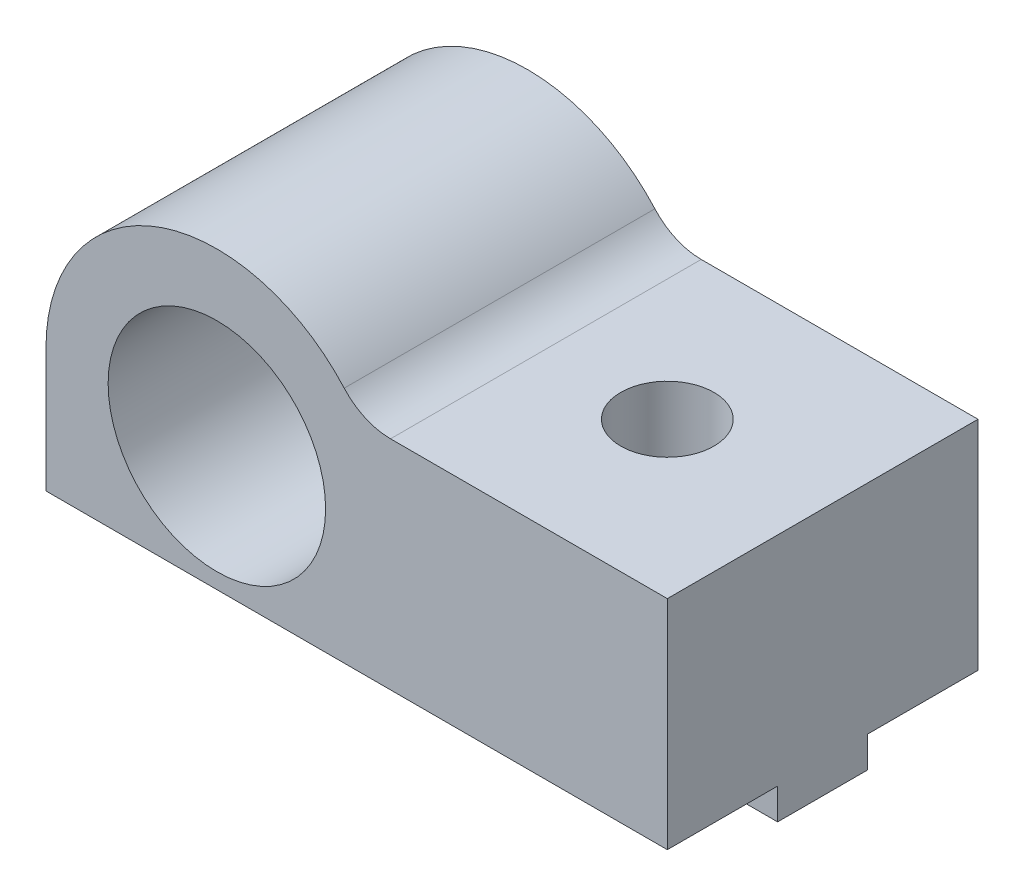
ISO-10303-21;
HEADER;
FILE_DESCRIPTION(('STEP AP214'),'2;1');
FILE_NAME('part.step','',(''),(''),'','','');
FILE_SCHEMA(('AUTOMOTIVE_DESIGN { 1 0 10303 214 1 1 1 1 }'));
ENDSEC;
DATA;
#1=APPLICATION_CONTEXT('core data for automotive mechanical design processes');
#2=APPLICATION_PROTOCOL_DEFINITION('international standard','automotive_design',2000,#1);
#3=PRODUCT_CONTEXT('',#1,'mechanical');
#4=PRODUCT('Part','Part','',(#3));
#5=PRODUCT_RELATED_PRODUCT_CATEGORY('part','',(#4));
#6=PRODUCT_DEFINITION_FORMATION('','',#4);
#7=PRODUCT_DEFINITION_CONTEXT('part definition',#1,'design');
#8=PRODUCT_DEFINITION('design','',#6,#7);
#9=PRODUCT_DEFINITION_SHAPE('','',#8);
#10=(LENGTH_UNIT() NAMED_UNIT(*) SI_UNIT(.MILLI.,.METRE.));
#11=(NAMED_UNIT(*) PLANE_ANGLE_UNIT() SI_UNIT($,.RADIAN.));
#12=(NAMED_UNIT(*) SI_UNIT($,.STERADIAN.) SOLID_ANGLE_UNIT());
#13=UNCERTAINTY_MEASURE_WITH_UNIT(LENGTH_MEASURE(1.E-05),#10,'distance_accuracy_value','');
#14=(GEOMETRIC_REPRESENTATION_CONTEXT(3) GLOBAL_UNCERTAINTY_ASSIGNED_CONTEXT((#13)) GLOBAL_UNIT_ASSIGNED_CONTEXT((#10,
#11,#12)) REPRESENTATION_CONTEXT('',''));
#15=CARTESIAN_POINT('',(0.,0.,0.));
#16=DIRECTION('',(0.,0.,1.));
#17=DIRECTION('',(1.,0.,0.));
#18=AXIS2_PLACEMENT_3D('',#15,#16,#17);
#19=CARTESIAN_POINT('',(-5.5,-5.,3.55));
#20=DIRECTION('',(0.,0.,1.));
#21=DIRECTION('',(1.,0.,0.));
#22=AXIS2_PLACEMENT_3D('',#19,#20,#21);
#23=PLANE('',#22);
#24=DIRECTION('',(1.,0.,0.));
#25=VECTOR('',#24,1.);
#26=CARTESIAN_POINT('',(-5.5,-5.,3.55));
#27=LINE('',#26,#25);
#28=CARTESIAN_POINT('',(9.88405728739344,-5.,3.55));
#29=VERTEX_POINT('',#28);
#30=CARTESIAN_POINT('',(14.5,-5.,3.55));
#31=VERTEX_POINT('',#30);
#32=EDGE_CURVE('E293',#29,#31,#27,.T.);
#33=ORIENTED_EDGE('',*,*,#32,.F.);
#34=DIRECTION('',(0.,1.,0.));
#35=VECTOR('',#34,1.);
#36=CARTESIAN_POINT('',(9.88405728739344,-5.,3.55));
#37=LINE('',#36,#35);
#38=CARTESIAN_POINT('',(9.88405728739344,-4.,3.55));
#39=VERTEX_POINT('',#38);
#40=EDGE_CURVE('E139',#29,#39,#37,.T.);
#41=ORIENTED_EDGE('',*,*,#40,.T.);
#42=DIRECTION('',(1.,0.,0.));
#43=VECTOR('',#42,1.);
#44=CARTESIAN_POINT('',(-5.5,-4.,3.55));
#45=LINE('',#44,#43);
#46=CARTESIAN_POINT('',(14.5,-4.,3.55));
#47=VERTEX_POINT('',#46);
#48=EDGE_CURVE('E173',#39,#47,#45,.T.);
#49=ORIENTED_EDGE('',*,*,#48,.T.);
#50=DIRECTION('',(0.,1.,0.));
#51=VECTOR('',#50,1.);
#52=CARTESIAN_POINT('',(14.5,-5.,3.55));
#53=LINE('',#52,#51);
#54=EDGE_CURVE('E177',#31,#47,#53,.T.);
#55=ORIENTED_EDGE('',*,*,#54,.F.);
#56=EDGE_LOOP('',(#33,#41,#49,#55));
#57=FACE_BOUND('',#56,.T.);
#58=ADVANCED_FACE('F33',(#57),#23,.F.);
#59=CARTESIAN_POINT('',(-5.5,-5.,6.45));
#60=DIRECTION('',(0.,0.,-1.));
#61=DIRECTION('',(-1.,0.,0.));
#62=AXIS2_PLACEMENT_3D('',#59,#60,#61);
#63=PLANE('',#62);
#64=DIRECTION('',(-1.,0.,0.));
#65=VECTOR('',#64,1.);
#66=CARTESIAN_POINT('',(-5.5,-5.,6.45));
#67=LINE('',#66,#65);
#68=CARTESIAN_POINT('',(9.11594271260657,-5.,6.45));
#69=VERTEX_POINT('',#68);
#70=CARTESIAN_POINT('',(-5.5,-5.,6.45));
#71=VERTEX_POINT('',#70);
#72=EDGE_CURVE('E161',#69,#71,#67,.T.);
#73=ORIENTED_EDGE('',*,*,#72,.F.);
#74=DIRECTION('',(0.,1.,0.));
#75=VECTOR('',#74,1.);
#76=CARTESIAN_POINT('',(9.11594271260657,-5.,6.45));
#77=LINE('',#76,#75);
#78=CARTESIAN_POINT('',(9.11594271260657,-4.,6.45));
#79=VERTEX_POINT('',#78);
#80=EDGE_CURVE('E288',#69,#79,#77,.T.);
#81=ORIENTED_EDGE('',*,*,#80,.T.);
#82=DIRECTION('',(-1.,0.,0.));
#83=VECTOR('',#82,1.);
#84=CARTESIAN_POINT('',(-5.5,-4.,6.45));
#85=LINE('',#84,#83);
#86=CARTESIAN_POINT('',(-5.5,-4.,6.45));
#87=VERTEX_POINT('',#86);
#88=EDGE_CURVE('E172',#79,#87,#85,.T.);
#89=ORIENTED_EDGE('',*,*,#88,.T.);
#90=DIRECTION('',(0.,1.,0.));
#91=VECTOR('',#90,1.);
#92=CARTESIAN_POINT('',(-5.5,-5.,6.45));
#93=LINE('',#92,#91);
#94=EDGE_CURVE('E160',#71,#87,#93,.T.);
#95=ORIENTED_EDGE('',*,*,#94,.F.);
#96=EDGE_LOOP('',(#73,#81,#89,#95));
#97=FACE_BOUND('',#96,.T.);
#98=ADVANCED_FACE('F258',(#97),#63,.F.);
#99=CARTESIAN_POINT('',(0.,-5.,0.));
#100=DIRECTION('',(0.,-1.,0.));
#101=DIRECTION('',(0.,0.,-1.));
#102=AXIS2_PLACEMENT_3D('',#99,#100,#101);
#103=PLANE('',#102);
#104=CARTESIAN_POINT('',(9.5,-5.,5.));
#105=DIRECTION('',(0.,-1.,0.));
#106=DIRECTION('',(0.,0.,-1.));
#107=AXIS2_PLACEMENT_3D('',#104,#105,#106);
#108=CIRCLE('',#107,1.5);
#109=CARTESIAN_POINT('',(9.88405728739343,-5.,6.45));
#110=VERTEX_POINT('',#109);
#111=EDGE_CURVE('E133',#29,#110,#108,.T.);
#112=ORIENTED_EDGE('',*,*,#111,.F.);
#113=ORIENTED_EDGE('',*,*,#32,.T.);
#114=DIRECTION('',(0.,0.,1.));
#115=VECTOR('',#114,1.);
#116=CARTESIAN_POINT('',(14.5,-5.,6.45));
#117=LINE('',#116,#115);
#118=CARTESIAN_POINT('',(14.5,-5.,6.45));
#119=VERTEX_POINT('',#118);
#120=EDGE_CURVE('E158',#31,#119,#117,.T.);
#121=ORIENTED_EDGE('',*,*,#120,.T.);
#122=EDGE_CURVE('E151',#119,#110,#67,.T.);
#123=ORIENTED_EDGE('',*,*,#122,.T.);
#124=EDGE_LOOP('',(#112,#113,#121,#123));
#125=FACE_BOUND('',#124,.T.);
#126=ADVANCED_FACE('F156',(#125),#103,.T.);
#127=CARTESIAN_POINT('',(-5.5,-4.,10.));
#128=DIRECTION('',(0.,1.,0.));
#129=DIRECTION('',(0.,0.,1.));
#130=AXIS2_PLACEMENT_3D('',#127,#128,#129);
#131=PLANE('',#130);
#132=ORIENTED_EDGE('',*,*,#88,.F.);
#133=CARTESIAN_POINT('',(9.5,-4.,5.));
#134=DIRECTION('',(0.,1.,0.));
#135=DIRECTION('',(0.,0.,1.));
#136=AXIS2_PLACEMENT_3D('',#133,#134,#135);
#137=CIRCLE('',#136,1.5);
#138=CARTESIAN_POINT('',(9.88405728739343,-4.,6.45));
#139=VERTEX_POINT('',#138);
#140=EDGE_CURVE('E153',#79,#139,#137,.T.);
#141=ORIENTED_EDGE('',*,*,#140,.T.);
#142=CARTESIAN_POINT('',(14.5,-4.,6.45));
#143=VERTEX_POINT('',#142);
#144=EDGE_CURVE('E152',#143,#139,#85,.T.);
#145=ORIENTED_EDGE('',*,*,#144,.F.);
#146=DIRECTION('',(0.,0.,-1.));
#147=VECTOR('',#146,1.);
#148=CARTESIAN_POINT('',(14.5,-4.,10.));
#149=LINE('',#148,#147);
#150=CARTESIAN_POINT('',(14.5,-4.,10.));
#151=VERTEX_POINT('',#150);
#152=EDGE_CURVE('E215',#151,#143,#149,.T.);
#153=ORIENTED_EDGE('',*,*,#152,.F.);
#154=DIRECTION('',(1.,0.,0.));
#155=VECTOR('',#154,1.);
#156=CARTESIAN_POINT('',(-5.5,-4.,10.));
#157=LINE('',#156,#155);
#158=CARTESIAN_POINT('',(-5.5,-4.,10.));
#159=VERTEX_POINT('',#158);
#160=EDGE_CURVE('E197',#159,#151,#157,.T.);
#161=ORIENTED_EDGE('',*,*,#160,.F.);
#162=DIRECTION('',(0.,0.,-1.));
#163=VECTOR('',#162,1.);
#164=CARTESIAN_POINT('',(-5.5,-4.,10.));
#165=LINE('',#164,#163);
#166=EDGE_CURVE('E219',#159,#87,#165,.T.);
#167=ORIENTED_EDGE('',*,*,#166,.T.);
#168=EDGE_LOOP('',(#132,#141,#145,#153,#161,#167));
#169=FACE_BOUND('',#168,.T.);
#170=ADVANCED_FACE('F303',(#169),#131,.F.);
#171=ORIENTED_EDGE('',*,*,#48,.F.);
#172=CARTESIAN_POINT('',(9.5,-4.,5.));
#173=DIRECTION('',(0.,1.,0.));
#174=DIRECTION('',(0.,0.,1.));
#175=AXIS2_PLACEMENT_3D('',#172,#173,#174);
#176=CIRCLE('',#175,1.5);
#177=CARTESIAN_POINT('',(9.11594271260656,-4.,3.55));
#178=VERTEX_POINT('',#177);
#179=EDGE_CURVE('E284',#39,#178,#176,.T.);
#180=ORIENTED_EDGE('',*,*,#179,.T.);
#181=CARTESIAN_POINT('',(-5.5,-4.,3.55));
#182=VERTEX_POINT('',#181);
#183=EDGE_CURVE('E169',#182,#178,#45,.T.);
#184=ORIENTED_EDGE('',*,*,#183,.F.);
#185=CARTESIAN_POINT('',(-5.5,-4.,0.));
#186=VERTEX_POINT('',#185);
#187=EDGE_CURVE('E218',#182,#186,#165,.T.);
#188=ORIENTED_EDGE('',*,*,#187,.T.);
#189=DIRECTION('',(1.,0.,0.));
#190=VECTOR('',#189,1.);
#191=CARTESIAN_POINT('',(-5.5,-4.,0.));
#192=LINE('',#191,#190);
#193=CARTESIAN_POINT('',(14.5,-4.,0.));
#194=VERTEX_POINT('',#193);
#195=EDGE_CURVE('E208',#186,#194,#192,.T.);
#196=ORIENTED_EDGE('',*,*,#195,.T.);
#197=EDGE_CURVE('E214',#47,#194,#149,.T.);
#198=ORIENTED_EDGE('',*,*,#197,.F.);
#199=EDGE_LOOP('',(#171,#180,#184,#188,#196,#198));
#200=FACE_BOUND('',#199,.T.);
#201=ADVANCED_FACE('F283',(#200),#131,.F.);
#202=CARTESIAN_POINT('',(0.,0.,10.));
#203=DIRECTION('',(0.,0.,-1.));
#204=DIRECTION('',(-1.,0.,0.));
#205=AXIS2_PLACEMENT_3D('',#202,#203,#204);
#206=PLANE('',#205);
#207=DIRECTION('',(-1.,0.,0.));
#208=VECTOR('',#207,1.);
#209=CARTESIAN_POINT('',(14.5,3.,10.));
#210=LINE('',#209,#208);
#211=CARTESIAN_POINT('',(14.5,3.,10.));
#212=VERTEX_POINT('',#211);
#213=CARTESIAN_POINT('',(5.59016994374947,3.,10.));
#214=VERTEX_POINT('',#213);
#215=EDGE_CURVE('E190',#212,#214,#210,.T.);
#216=ORIENTED_EDGE('',*,*,#215,.T.);
#217=CARTESIAN_POINT('',(5.59016994374947,5.,10.));
#218=DIRECTION('',(0.,0.,-1.));
#219=DIRECTION('',(-1.,0.,0.));
#220=AXIS2_PLACEMENT_3D('',#217,#218,#219);
#221=CIRCLE('',#220,2.);
#222=CARTESIAN_POINT('',(4.09945795874961,3.66666666666667,10.));
#223=VERTEX_POINT('',#222);
#224=EDGE_CURVE('E11',#214,#223,#221,.T.);
#225=ORIENTED_EDGE('',*,*,#224,.T.);
#226=CARTESIAN_POINT('',(0.,0.,10.));
#227=DIRECTION('',(0.,0.,1.));
#228=DIRECTION('',(-1.,0.,0.));
#229=AXIS2_PLACEMENT_3D('',#226,#227,#228);
#230=CIRCLE('',#229,5.5);
#231=CARTESIAN_POINT('',(-5.5,0.,10.));
#232=VERTEX_POINT('',#231);
#233=EDGE_CURVE('E192',#223,#232,#230,.T.);
#234=ORIENTED_EDGE('',*,*,#233,.T.);
#235=DIRECTION('',(0.,-1.,0.));
#236=VECTOR('',#235,1.);
#237=CARTESIAN_POINT('',(-5.5,0.,10.));
#238=LINE('',#237,#236);
#239=EDGE_CURVE('E195',#232,#159,#238,.T.);
#240=ORIENTED_EDGE('',*,*,#239,.T.);
#241=ORIENTED_EDGE('',*,*,#160,.T.);
#242=DIRECTION('',(0.,1.,0.));
#243=VECTOR('',#242,1.);
#244=CARTESIAN_POINT('',(14.5,-4.,10.));
#245=LINE('',#244,#243);
#246=EDGE_CURVE('E199',#151,#212,#245,.T.);
#247=ORIENTED_EDGE('',*,*,#246,.T.);
#248=EDGE_LOOP('',(#216,#225,#234,#240,#241,#247));
#249=FACE_BOUND('',#248,.T.);
#250=CARTESIAN_POINT('',(0.,0.,10.));
#251=DIRECTION('',(0.,0.,1.));
#252=DIRECTION('',(1.,0.,0.));
#253=AXIS2_PLACEMENT_3D('',#250,#251,#252);
#254=CIRCLE('',#253,3.5);
#255=CARTESIAN_POINT('',(3.5,0.,10.));
#256=VERTEX_POINT('',#255);
#257=EDGE_CURVE('E184',#256,#256,#254,.T.);
#258=ORIENTED_EDGE('',*,*,#257,.F.);
#259=EDGE_LOOP('',(#258));
#260=FACE_BOUND('',#259,.T.);
#261=ADVANCED_FACE('F247',(#249,#260),#206,.F.);
#262=CARTESIAN_POINT('',(0.,0.,0.));
#263=DIRECTION('',(0.,0.,-1.));
#264=DIRECTION('',(-1.,0.,0.));
#265=AXIS2_PLACEMENT_3D('',#262,#263,#264);
#266=PLANE('',#265);
#267=DIRECTION('',(-1.,0.,0.));
#268=VECTOR('',#267,1.);
#269=CARTESIAN_POINT('',(14.5,3.,0.));
#270=LINE('',#269,#268);
#271=CARTESIAN_POINT('',(14.5,3.,0.));
#272=VERTEX_POINT('',#271);
#273=CARTESIAN_POINT('',(5.59016994374947,3.,0.));
#274=VERTEX_POINT('',#273);
#275=EDGE_CURVE('E187',#272,#274,#270,.T.);
#276=ORIENTED_EDGE('',*,*,#275,.F.);
#277=DIRECTION('',(0.,1.,0.));
#278=VECTOR('',#277,1.);
#279=CARTESIAN_POINT('',(14.5,-4.,0.));
#280=LINE('',#279,#278);
#281=EDGE_CURVE('E193',#194,#272,#280,.T.);
#282=ORIENTED_EDGE('',*,*,#281,.F.);
#283=ORIENTED_EDGE('',*,*,#195,.F.);
#284=DIRECTION('',(0.,-1.,0.));
#285=VECTOR('',#284,1.);
#286=CARTESIAN_POINT('',(-5.5,0.,0.));
#287=LINE('',#286,#285);
#288=CARTESIAN_POINT('',(-5.5,0.,0.));
#289=VERTEX_POINT('',#288);
#290=EDGE_CURVE('E205',#289,#186,#287,.T.);
#291=ORIENTED_EDGE('',*,*,#290,.F.);
#292=CARTESIAN_POINT('',(0.,0.,0.));
#293=DIRECTION('',(0.,0.,1.));
#294=DIRECTION('',(-1.,0.,0.));
#295=AXIS2_PLACEMENT_3D('',#292,#293,#294);
#296=CIRCLE('',#295,5.5);
#297=CARTESIAN_POINT('',(4.09945795874961,3.66666666666667,0.));
#298=VERTEX_POINT('',#297);
#299=EDGE_CURVE('E203',#298,#289,#296,.T.);
#300=ORIENTED_EDGE('',*,*,#299,.F.);
#301=CARTESIAN_POINT('',(5.59016994374947,5.,0.));
#302=DIRECTION('',(0.,0.,-1.));
#303=DIRECTION('',(-1.,0.,0.));
#304=AXIS2_PLACEMENT_3D('',#301,#302,#303);
#305=CIRCLE('',#304,2.);
#306=EDGE_CURVE('E41',#298,#274,#305,.F.);
#307=ORIENTED_EDGE('',*,*,#306,.T.);
#308=EDGE_LOOP('',(#276,#282,#283,#291,#300,#307));
#309=FACE_BOUND('',#308,.T.);
#310=CARTESIAN_POINT('',(0.,0.,0.));
#311=DIRECTION('',(0.,0.,1.));
#312=DIRECTION('',(1.,0.,0.));
#313=AXIS2_PLACEMENT_3D('',#310,#311,#312);
#314=CIRCLE('',#313,3.5);
#315=CARTESIAN_POINT('',(3.5,0.,0.));
#316=VERTEX_POINT('',#315);
#317=EDGE_CURVE('E183',#316,#316,#314,.T.);
#318=ORIENTED_EDGE('',*,*,#317,.T.);
#319=EDGE_LOOP('',(#318));
#320=FACE_BOUND('',#319,.T.);
#321=ADVANCED_FACE('F235',(#309,#320),#266,.T.);
#322=CARTESIAN_POINT('',(14.5,3.,10.));
#323=DIRECTION('',(0.,-1.,0.));
#324=DIRECTION('',(1.,0.,0.));
#325=AXIS2_PLACEMENT_3D('',#322,#323,#324);
#326=PLANE('',#325);
#327=CARTESIAN_POINT('',(9.5,3.,5.));
#328=DIRECTION('',(0.,1.,0.));
#329=DIRECTION('',(-1.,0.,0.));
#330=AXIS2_PLACEMENT_3D('',#327,#328,#329);
#331=CIRCLE('',#330,1.5);
#332=CARTESIAN_POINT('',(8.,3.,5.));
#333=VERTEX_POINT('',#332);
#334=EDGE_CURVE('E154',#333,#333,#331,.T.);
#335=ORIENTED_EDGE('',*,*,#334,.F.);
#336=EDGE_LOOP('',(#335));
#337=FACE_BOUND('',#336,.T.);
#338=ORIENTED_EDGE('',*,*,#275,.T.);
#339=DIRECTION('',(0.,0.,1.));
#340=VECTOR('',#339,1.);
#341=CARTESIAN_POINT('',(5.59016994374947,3.,10.));
#342=LINE('',#341,#340);
#343=EDGE_CURVE('E48',#274,#214,#342,.T.);
#344=ORIENTED_EDGE('',*,*,#343,.T.);
#345=ORIENTED_EDGE('',*,*,#215,.F.);
#346=DIRECTION('',(0.,0.,-1.));
#347=VECTOR('',#346,1.);
#348=CARTESIAN_POINT('',(14.5,3.,10.));
#349=LINE('',#348,#347);
#350=EDGE_CURVE('E201',#212,#272,#349,.T.);
#351=ORIENTED_EDGE('',*,*,#350,.T.);
#352=EDGE_LOOP('',(#338,#344,#345,#351));
#353=FACE_BOUND('',#352,.T.);
#354=ADVANCED_FACE('F310',(#337,#353),#326,.F.);
#355=CARTESIAN_POINT('',(0.,0.,10.));
#356=DIRECTION('',(0.,0.,-1.));
#357=DIRECTION('',(-1.,0.,0.));
#358=AXIS2_PLACEMENT_3D('',#355,#356,#357);
#359=CYLINDRICAL_SURFACE('',#358,5.5);
#360=ORIENTED_EDGE('',*,*,#233,.F.);
#361=DIRECTION('',(0.,0.,-1.));
#362=VECTOR('',#361,1.);
#363=CARTESIAN_POINT('',(4.09945795874961,3.66666666666667,10.));
#364=LINE('',#363,#362);
#365=EDGE_CURVE('E143',#223,#298,#364,.T.);
#366=ORIENTED_EDGE('',*,*,#365,.T.);
#367=ORIENTED_EDGE('',*,*,#299,.T.);
#368=DIRECTION('',(0.,0.,-1.));
#369=VECTOR('',#368,1.);
#370=CARTESIAN_POINT('',(-5.5,0.,10.));
#371=LINE('',#370,#369);
#372=EDGE_CURVE('E222',#232,#289,#371,.T.);
#373=ORIENTED_EDGE('',*,*,#372,.F.);
#374=EDGE_LOOP('',(#360,#366,#367,#373));
#375=FACE_BOUND('',#374,.T.);
#376=ADVANCED_FACE('F230',(#375),#359,.T.);
#377=CARTESIAN_POINT('',(-5.5,0.,10.));
#378=DIRECTION('',(1.,0.,0.));
#379=DIRECTION('',(0.,1.,0.));
#380=AXIS2_PLACEMENT_3D('',#377,#378,#379);
#381=PLANE('',#380);
#382=ORIENTED_EDGE('',*,*,#290,.T.);
#383=ORIENTED_EDGE('',*,*,#187,.F.);
#384=DIRECTION('',(0.,1.,0.));
#385=VECTOR('',#384,1.);
#386=CARTESIAN_POINT('',(-5.5,-5.,3.55));
#387=LINE('',#386,#385);
#388=CARTESIAN_POINT('',(-5.5,-5.,3.55));
#389=VERTEX_POINT('',#388);
#390=EDGE_CURVE('E180',#389,#182,#387,.T.);
#391=ORIENTED_EDGE('',*,*,#390,.F.);
#392=DIRECTION('',(0.,0.,-1.));
#393=VECTOR('',#392,1.);
#394=CARTESIAN_POINT('',(-5.5,-5.,6.45));
#395=LINE('',#394,#393);
#396=EDGE_CURVE('E174',#71,#389,#395,.T.);
#397=ORIENTED_EDGE('',*,*,#396,.F.);
#398=ORIENTED_EDGE('',*,*,#94,.T.);
#399=ORIENTED_EDGE('',*,*,#166,.F.);
#400=ORIENTED_EDGE('',*,*,#239,.F.);
#401=ORIENTED_EDGE('',*,*,#372,.T.);
#402=EDGE_LOOP('',(#382,#383,#391,#397,#398,#399,#400,#401));
#403=FACE_BOUND('',#402,.T.);
#404=ADVANCED_FACE('F241',(#403),#381,.F.);
#405=CARTESIAN_POINT('',(14.5,-4.,10.));
#406=DIRECTION('',(-1.,0.,0.));
#407=DIRECTION('',(0.,-1.,0.));
#408=AXIS2_PLACEMENT_3D('',#405,#406,#407);
#409=PLANE('',#408);
#410=ORIENTED_EDGE('',*,*,#281,.T.);
#411=ORIENTED_EDGE('',*,*,#350,.F.);
#412=ORIENTED_EDGE('',*,*,#246,.F.);
#413=ORIENTED_EDGE('',*,*,#152,.T.);
#414=DIRECTION('',(0.,1.,0.));
#415=VECTOR('',#414,1.);
#416=CARTESIAN_POINT('',(14.5,-5.,6.45));
#417=LINE('',#416,#415);
#418=EDGE_CURVE('E164',#119,#143,#417,.T.);
#419=ORIENTED_EDGE('',*,*,#418,.F.);
#420=ORIENTED_EDGE('',*,*,#120,.F.);
#421=ORIENTED_EDGE('',*,*,#54,.T.);
#422=ORIENTED_EDGE('',*,*,#197,.T.);
#423=EDGE_LOOP('',(#410,#411,#412,#413,#419,#420,#421,#422));
#424=FACE_BOUND('',#423,.T.);
#425=ADVANCED_FACE('F275',(#424),#409,.F.);
#426=CARTESIAN_POINT('',(0.,0.,10.));
#427=DIRECTION('',(0.,0.,-1.));
#428=DIRECTION('',(-1.,0.,0.));
#429=AXIS2_PLACEMENT_3D('',#426,#427,#428);
#430=CYLINDRICAL_SURFACE('',#429,3.5);
#431=ORIENTED_EDGE('',*,*,#257,.T.);
#432=EDGE_LOOP('',(#431));
#433=FACE_BOUND('',#432,.T.);
#434=ORIENTED_EDGE('',*,*,#317,.F.);
#435=EDGE_LOOP('',(#434));
#436=FACE_BOUND('',#435,.T.);
#437=ADVANCED_FACE('F269',(#433,#436),#430,.F.);
#438=ORIENTED_EDGE('',*,*,#183,.T.);
#439=DIRECTION('',(0.,1.,0.));
#440=VECTOR('',#439,1.);
#441=CARTESIAN_POINT('',(9.11594271260656,-5.,3.55));
#442=LINE('',#441,#440);
#443=CARTESIAN_POINT('',(9.11594271260656,-5.,3.55));
#444=VERTEX_POINT('',#443);
#445=EDGE_CURVE('E278',#178,#444,#442,.F.);
#446=ORIENTED_EDGE('',*,*,#445,.T.);
#447=EDGE_CURVE('E294',#389,#444,#27,.T.);
#448=ORIENTED_EDGE('',*,*,#447,.F.);
#449=ORIENTED_EDGE('',*,*,#390,.T.);
#450=EDGE_LOOP('',(#438,#446,#448,#449));
#451=FACE_BOUND('',#450,.T.);
#452=ADVANCED_FACE('F261',(#451),#23,.F.);
#453=ORIENTED_EDGE('',*,*,#144,.T.);
#454=DIRECTION('',(0.,1.,0.));
#455=VECTOR('',#454,1.);
#456=CARTESIAN_POINT('',(9.88405728739343,-5.,6.45));
#457=LINE('',#456,#455);
#458=EDGE_CURVE('E136',#139,#110,#457,.F.);
#459=ORIENTED_EDGE('',*,*,#458,.T.);
#460=ORIENTED_EDGE('',*,*,#122,.F.);
#461=ORIENTED_EDGE('',*,*,#418,.T.);
#462=EDGE_LOOP('',(#453,#459,#460,#461));
#463=FACE_BOUND('',#462,.T.);
#464=ADVANCED_FACE('F149',(#463),#63,.F.);
#465=EDGE_CURVE('E144',#69,#444,#108,.T.);
#466=ORIENTED_EDGE('',*,*,#465,.F.);
#467=ORIENTED_EDGE('',*,*,#72,.T.);
#468=ORIENTED_EDGE('',*,*,#396,.T.);
#469=ORIENTED_EDGE('',*,*,#447,.T.);
#470=EDGE_LOOP('',(#466,#467,#468,#469));
#471=FACE_BOUND('',#470,.T.);
#472=ADVANCED_FACE('F254',(#471),#103,.T.);
#473=CARTESIAN_POINT('',(9.5,-5.,5.));
#474=DIRECTION('',(0.,1.,0.));
#475=DIRECTION('',(-1.,0.,0.));
#476=AXIS2_PLACEMENT_3D('',#473,#474,#475);
#477=CYLINDRICAL_SURFACE('',#476,1.5);
#478=ORIENTED_EDGE('',*,*,#334,.T.);
#479=EDGE_LOOP('',(#478));
#480=FACE_BOUND('',#479,.T.);
#481=ORIENTED_EDGE('',*,*,#111,.T.);
#482=ORIENTED_EDGE('',*,*,#458,.F.);
#483=ORIENTED_EDGE('',*,*,#140,.F.);
#484=ORIENTED_EDGE('',*,*,#80,.F.);
#485=ORIENTED_EDGE('',*,*,#465,.T.);
#486=ORIENTED_EDGE('',*,*,#445,.F.);
#487=ORIENTED_EDGE('',*,*,#179,.F.);
#488=ORIENTED_EDGE('',*,*,#40,.F.);
#489=EDGE_LOOP('',(#481,#482,#483,#484,#485,#486,#487,#488));
#490=FACE_BOUND('',#489,.T.);
#491=ADVANCED_FACE('F135',(#480,#490),#477,.F.);
#492=CARTESIAN_POINT('',(5.59016994374947,5.,10.));
#493=DIRECTION('',(0.,0.,-1.));
#494=DIRECTION('',(-1.,0.,0.));
#495=AXIS2_PLACEMENT_3D('',#492,#493,#494);
#496=CYLINDRICAL_SURFACE('',#495,2.);
#497=ORIENTED_EDGE('',*,*,#224,.F.);
#498=ORIENTED_EDGE('',*,*,#343,.F.);
#499=ORIENTED_EDGE('',*,*,#306,.F.);
#500=ORIENTED_EDGE('',*,*,#365,.F.);
#501=EDGE_LOOP('',(#497,#498,#499,#500));
#502=FACE_BOUND('',#501,.T.);
#503=ADVANCED_FACE('F35',(#502),#496,.F.);
#504=CLOSED_SHELL('',(#58,#98,#126,#170,#201,#261,#321,#354,#376,#404,#425,#437,#452,#464,#472,
#491,#503));
#505=MANIFOLD_SOLID_BREP('B2',#504);
#506=ADVANCED_BREP_SHAPE_REPRESENTATION('',(#18,#505),#14);
#507=SHAPE_DEFINITION_REPRESENTATION(#9,#506);
ENDSEC;
END-ISO-10303-21;
